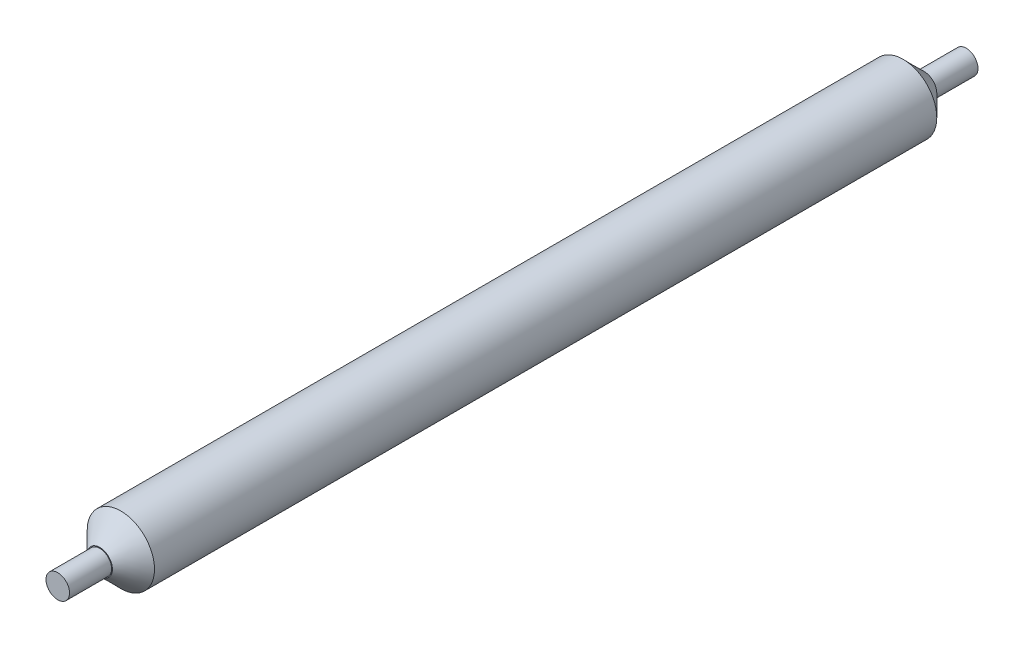
ISO-10303-21;
HEADER;
FILE_DESCRIPTION(('STEP AP214'),'2;1');
FILE_NAME('part.step','',(''),(''),'','','');
FILE_SCHEMA(('AUTOMOTIVE_DESIGN { 1 0 10303 214 1 1 1 1 }'));
ENDSEC;
DATA;
#1=APPLICATION_CONTEXT('core data for automotive mechanical design processes');
#2=APPLICATION_PROTOCOL_DEFINITION('international standard','automotive_design',2000,#1);
#3=PRODUCT_CONTEXT('',#1,'mechanical');
#4=PRODUCT('Part','Part','',(#3));
#5=PRODUCT_RELATED_PRODUCT_CATEGORY('part','',(#4));
#6=PRODUCT_DEFINITION_FORMATION('','',#4);
#7=PRODUCT_DEFINITION_CONTEXT('part definition',#1,'design');
#8=PRODUCT_DEFINITION('design','',#6,#7);
#9=PRODUCT_DEFINITION_SHAPE('','',#8);
#10=(LENGTH_UNIT() NAMED_UNIT(*) SI_UNIT(.MILLI.,.METRE.));
#11=(NAMED_UNIT(*) PLANE_ANGLE_UNIT() SI_UNIT($,.RADIAN.));
#12=(NAMED_UNIT(*) SI_UNIT($,.STERADIAN.) SOLID_ANGLE_UNIT());
#13=UNCERTAINTY_MEASURE_WITH_UNIT(LENGTH_MEASURE(1.E-05),#10,'distance_accuracy_value','');
#14=(GEOMETRIC_REPRESENTATION_CONTEXT(3) GLOBAL_UNCERTAINTY_ASSIGNED_CONTEXT((#13)) GLOBAL_UNIT_ASSIGNED_CONTEXT((#10,
#11,#12)) REPRESENTATION_CONTEXT('',''));
#15=CARTESIAN_POINT('',(0.,0.,0.));
#16=DIRECTION('',(0.,0.,1.));
#17=DIRECTION('',(1.,0.,0.));
#18=AXIS2_PLACEMENT_3D('',#15,#16,#17);
#19=CARTESIAN_POINT('',(0.,0.,-54.));
#20=DIRECTION('',(0.,0.,1.));
#21=DIRECTION('',(1.,0.,0.));
#22=AXIS2_PLACEMENT_3D('',#19,#20,#21);
#23=CYLINDRICAL_SURFACE('',#22,1.4);
#24=CARTESIAN_POINT('',(0.,0.,-54.));
#25=DIRECTION('',(0.,0.,1.));
#26=DIRECTION('',(1.,0.,0.));
#27=AXIS2_PLACEMENT_3D('',#24,#25,#26);
#28=CIRCLE('',#27,1.4);
#29=CARTESIAN_POINT('',(1.4,0.,-54.));
#30=VERTEX_POINT('',#29);
#31=EDGE_CURVE('E79',#30,#30,#28,.T.);
#32=ORIENTED_EDGE('',*,*,#31,.T.);
#33=EDGE_LOOP('',(#32));
#34=FACE_BOUND('',#33,.T.);
#35=CARTESIAN_POINT('',(0.,0.,-49.));
#36=DIRECTION('',(0.,0.,1.));
#37=DIRECTION('',(1.,0.,0.));
#38=AXIS2_PLACEMENT_3D('',#35,#36,#37);
#39=CIRCLE('',#38,1.4);
#40=CARTESIAN_POINT('',(1.4,0.,-49.));
#41=VERTEX_POINT('',#40);
#42=EDGE_CURVE('E71',#41,#41,#39,.F.);
#43=ORIENTED_EDGE('',*,*,#42,.T.);
#44=EDGE_LOOP('',(#43));
#45=FACE_BOUND('',#44,.T.);
#46=ADVANCED_FACE('F45',(#34,#45),#23,.T.);
#47=CARTESIAN_POINT('',(0.,0.,-54.));
#48=DIRECTION('',(0.,0.,1.));
#49=DIRECTION('',(1.,0.,0.));
#50=AXIS2_PLACEMENT_3D('',#47,#48,#49);
#51=PLANE('',#50);
#52=ORIENTED_EDGE('',*,*,#31,.F.);
#53=EDGE_LOOP('',(#52));
#54=FACE_BOUND('',#53,.T.);
#55=ADVANCED_FACE('F104',(#54),#51,.F.);
#56=CARTESIAN_POINT('',(0.,0.,-49.));
#57=DIRECTION('',(0.,0.,1.));
#58=DIRECTION('',(1.,0.,0.));
#59=AXIS2_PLACEMENT_3D('',#56,#57,#58);
#60=CYLINDRICAL_SURFACE('',#59,4.);
#61=CARTESIAN_POINT('',(0.,0.,-46.5));
#62=DIRECTION('',(0.,0.,1.));
#63=DIRECTION('',(1.,0.,0.));
#64=AXIS2_PLACEMENT_3D('',#61,#62,#63);
#65=CIRCLE('',#64,4.);
#66=CARTESIAN_POINT('',(4.,0.,-46.5));
#67=VERTEX_POINT('',#66);
#68=EDGE_CURVE('E59',#67,#67,#65,.T.);
#69=ORIENTED_EDGE('',*,*,#68,.T.);
#70=EDGE_LOOP('',(#69));
#71=FACE_BOUND('',#70,.T.);
#72=CARTESIAN_POINT('',(0.,0.,46.5));
#73=DIRECTION('',(0.,0.,1.));
#74=DIRECTION('',(1.,0.,0.));
#75=AXIS2_PLACEMENT_3D('',#72,#73,#74);
#76=CIRCLE('',#75,4.);
#77=CARTESIAN_POINT('',(4.,0.,46.5));
#78=VERTEX_POINT('',#77);
#79=EDGE_CURVE('E64',#78,#78,#76,.F.);
#80=ORIENTED_EDGE('',*,*,#79,.T.);
#81=EDGE_LOOP('',(#80));
#82=FACE_BOUND('',#81,.T.);
#83=ADVANCED_FACE('F109',(#71,#82),#60,.T.);
#84=CARTESIAN_POINT('',(0.,0.,-49.));
#85=DIRECTION('',(0.,0.,1.));
#86=DIRECTION('',(1.,0.,0.));
#87=AXIS2_PLACEMENT_3D('',#84,#85,#86);
#88=PLANE('',#87);
#89=CARTESIAN_POINT('',(0.,0.,-49.));
#90=DIRECTION('',(0.,0.,1.));
#91=DIRECTION('',(1.,0.,0.));
#92=AXIS2_PLACEMENT_3D('',#89,#90,#91);
#93=CIRCLE('',#92,1.50000000000002);
#94=CARTESIAN_POINT('',(1.50000000000002,0.,-49.));
#95=VERTEX_POINT('',#94);
#96=EDGE_CURVE('E54',#95,#95,#93,.F.);
#97=ORIENTED_EDGE('',*,*,#96,.T.);
#98=EDGE_LOOP('',(#97));
#99=FACE_BOUND('',#98,.T.);
#100=ORIENTED_EDGE('',*,*,#42,.F.);
#101=EDGE_LOOP('',(#100));
#102=FACE_BOUND('',#101,.T.);
#103=ADVANCED_FACE('F115',(#99,#102),#88,.F.);
#104=CARTESIAN_POINT('',(0.,0.,49.));
#105=DIRECTION('',(0.,0.,1.));
#106=DIRECTION('',(1.,0.,0.));
#107=AXIS2_PLACEMENT_3D('',#104,#105,#106);
#108=PLANE('',#107);
#109=CARTESIAN_POINT('',(0.,0.,49.));
#110=DIRECTION('',(0.,0.,1.));
#111=DIRECTION('',(1.,0.,0.));
#112=AXIS2_PLACEMENT_3D('',#109,#110,#111);
#113=CIRCLE('',#112,1.5);
#114=CARTESIAN_POINT('',(1.5,0.,49.));
#115=VERTEX_POINT('',#114);
#116=EDGE_CURVE('E10',#115,#115,#113,.T.);
#117=ORIENTED_EDGE('',*,*,#116,.T.);
#118=EDGE_LOOP('',(#117));
#119=FACE_BOUND('',#118,.T.);
#120=CARTESIAN_POINT('',(0.,0.,49.));
#121=DIRECTION('',(0.,0.,1.));
#122=DIRECTION('',(1.,0.,0.));
#123=AXIS2_PLACEMENT_3D('',#120,#121,#122);
#124=CIRCLE('',#123,1.4);
#125=CARTESIAN_POINT('',(1.4,0.,49.));
#126=VERTEX_POINT('',#125);
#127=EDGE_CURVE('E70',#126,#126,#124,.F.);
#128=ORIENTED_EDGE('',*,*,#127,.T.);
#129=EDGE_LOOP('',(#128));
#130=FACE_BOUND('',#129,.T.);
#131=ADVANCED_FACE('F99',(#119,#130),#108,.T.);
#132=CARTESIAN_POINT('',(0.,0.,54.));
#133=DIRECTION('',(0.,0.,1.));
#134=DIRECTION('',(1.,0.,0.));
#135=AXIS2_PLACEMENT_3D('',#132,#133,#134);
#136=PLANE('',#135);
#137=CARTESIAN_POINT('',(0.,0.,54.));
#138=DIRECTION('',(0.,0.,1.));
#139=DIRECTION('',(1.,0.,0.));
#140=AXIS2_PLACEMENT_3D('',#137,#138,#139);
#141=CIRCLE('',#140,1.4);
#142=CARTESIAN_POINT('',(1.4,0.,54.));
#143=VERTEX_POINT('',#142);
#144=EDGE_CURVE('E75',#143,#143,#141,.T.);
#145=ORIENTED_EDGE('',*,*,#144,.T.);
#146=EDGE_LOOP('',(#145));
#147=FACE_BOUND('',#146,.T.);
#148=ADVANCED_FACE('F87',(#147),#136,.T.);
#149=ORIENTED_EDGE('',*,*,#127,.F.);
#150=EDGE_LOOP('',(#149));
#151=FACE_BOUND('',#150,.T.);
#152=ORIENTED_EDGE('',*,*,#144,.F.);
#153=EDGE_LOOP('',(#152));
#154=FACE_BOUND('',#153,.T.);
#155=ADVANCED_FACE('F89',(#151,#154),#23,.T.);
#156=CARTESIAN_POINT('',(0.,0.,-46.5));
#157=DIRECTION('',(0.,0.,1.));
#158=DIRECTION('',(1.,0.,0.));
#159=AXIS2_PLACEMENT_3D('',#156,#157,#158);
#160=CONICAL_SURFACE('',#159,4.,0.78539816339745);
#161=ORIENTED_EDGE('',*,*,#96,.F.);
#162=EDGE_LOOP('',(#161));
#163=FACE_BOUND('',#162,.T.);
#164=ORIENTED_EDGE('',*,*,#68,.F.);
#165=EDGE_LOOP('',(#164));
#166=FACE_BOUND('',#165,.T.);
#167=ADVANCED_FACE('F91',(#163,#166),#160,.T.);
#168=CARTESIAN_POINT('',(0.,0.,49.));
#169=DIRECTION('',(0.,0.,-1.));
#170=DIRECTION('',(-1.,0.,0.));
#171=AXIS2_PLACEMENT_3D('',#168,#169,#170);
#172=CONICAL_SURFACE('',#171,1.5,0.785398163397445);
#173=ORIENTED_EDGE('',*,*,#79,.F.);
#174=EDGE_LOOP('',(#173));
#175=FACE_BOUND('',#174,.T.);
#176=ORIENTED_EDGE('',*,*,#116,.F.);
#177=EDGE_LOOP('',(#176));
#178=FACE_BOUND('',#177,.T.);
#179=ADVANCED_FACE('F48',(#175,#178),#172,.T.);
#180=CLOSED_SHELL('',(#46,#55,#83,#103,#131,#148,#155,#167,#179));
#181=MANIFOLD_SOLID_BREP('B2',#180);
#182=ADVANCED_BREP_SHAPE_REPRESENTATION('',(#18,#181),#14);
#183=SHAPE_DEFINITION_REPRESENTATION(#9,#182);
ENDSEC;
END-ISO-10303-21;
